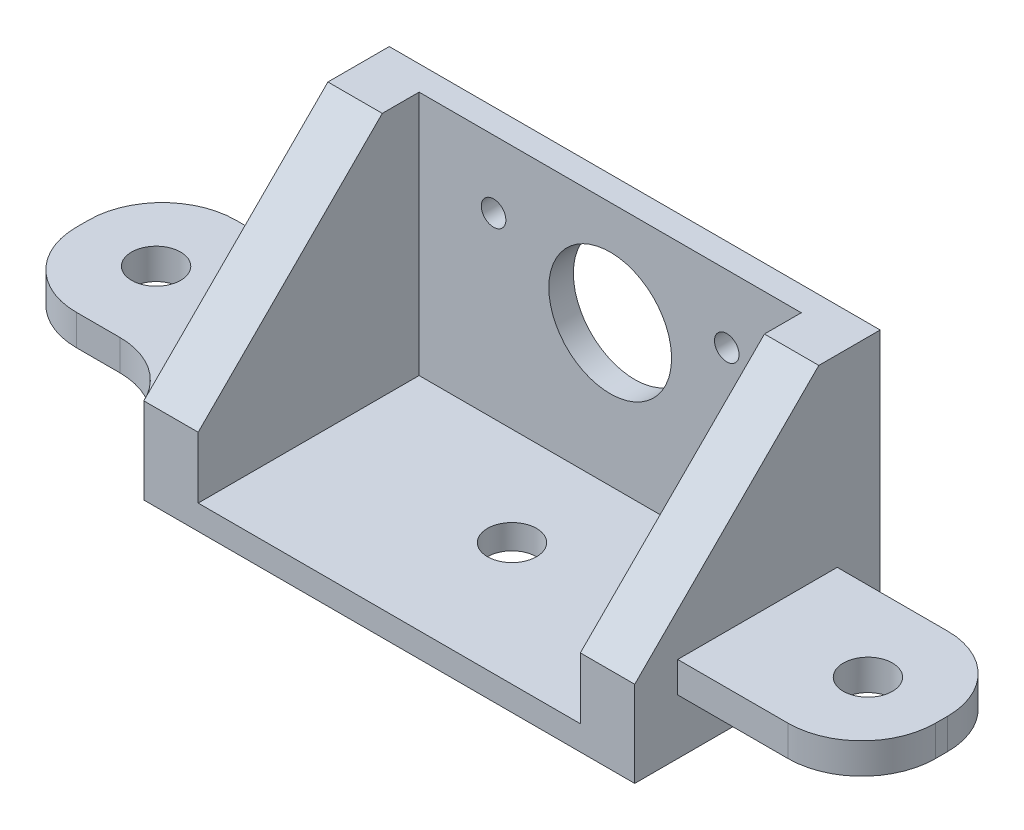
ISO-10303-21;
HEADER;
FILE_DESCRIPTION(('STEP AP214'),'2;1');
FILE_NAME('part.step','',(''),(''),'','','');
FILE_SCHEMA(('AUTOMOTIVE_DESIGN { 1 0 10303 214 1 1 1 1 }'));
ENDSEC;
DATA;
#1=APPLICATION_CONTEXT('core data for automotive mechanical design processes');
#2=APPLICATION_PROTOCOL_DEFINITION('international standard','automotive_design',2000,#1);
#3=PRODUCT_CONTEXT('',#1,'mechanical');
#4=PRODUCT('Part','Part','',(#3));
#5=PRODUCT_RELATED_PRODUCT_CATEGORY('part','',(#4));
#6=PRODUCT_DEFINITION_FORMATION('','',#4);
#7=PRODUCT_DEFINITION_CONTEXT('part definition',#1,'design');
#8=PRODUCT_DEFINITION('design','',#6,#7);
#9=PRODUCT_DEFINITION_SHAPE('','',#8);
#10=(LENGTH_UNIT() NAMED_UNIT(*) SI_UNIT(.MILLI.,.METRE.));
#11=(NAMED_UNIT(*) PLANE_ANGLE_UNIT() SI_UNIT($,.RADIAN.));
#12=(NAMED_UNIT(*) SI_UNIT($,.STERADIAN.) SOLID_ANGLE_UNIT());
#13=UNCERTAINTY_MEASURE_WITH_UNIT(LENGTH_MEASURE(1.E-05),#10,'distance_accuracy_value','');
#14=(GEOMETRIC_REPRESENTATION_CONTEXT(3) GLOBAL_UNCERTAINTY_ASSIGNED_CONTEXT((#13)) GLOBAL_UNIT_ASSIGNED_CONTEXT((#10,
#11,#12)) REPRESENTATION_CONTEXT('',''));
#15=CARTESIAN_POINT('',(0.,0.,0.));
#16=DIRECTION('',(0.,0.,1.));
#17=DIRECTION('',(1.,0.,0.));
#18=AXIS2_PLACEMENT_3D('',#15,#16,#17);
#19=CARTESIAN_POINT('',(-20.,2.,-10.));
#20=DIRECTION('',(1.,0.,0.));
#21=DIRECTION('',(0.,0.,-1.));
#22=AXIS2_PLACEMENT_3D('',#19,#20,#21);
#23=PLANE('',#22);
#24=DIRECTION('',(0.,0.,-1.));
#25=VECTOR('',#24,1.);
#26=CARTESIAN_POINT('',(-20.,6.99999999999995,6.5));
#27=LINE('',#26,#25);
#28=CARTESIAN_POINT('',(-20.,6.99999999999995,10.));
#29=VERTEX_POINT('',#28);
#30=CARTESIAN_POINT('',(-20.,6.99999999999995,-10.));
#31=VERTEX_POINT('',#30);
#32=EDGE_CURVE('E281',#29,#31,#27,.T.);
#33=ORIENTED_EDGE('',*,*,#32,.F.);
#34=DIRECTION('',(0.,0.707106781186549,-0.707106781186546));
#35=VECTOR('',#34,1.);
#36=CARTESIAN_POINT('',(-20.,22.,-4.99999999999999));
#37=LINE('',#36,#35);
#38=CARTESIAN_POINT('',(-20.,22.,-5.));
#39=VERTEX_POINT('',#38);
#40=EDGE_CURVE('E414',#29,#39,#37,.T.);
#41=ORIENTED_EDGE('',*,*,#40,.T.);
#42=DIRECTION('',(0.,0.,1.));
#43=VECTOR('',#42,1.);
#44=CARTESIAN_POINT('',(-20.,22.,-10.));
#45=LINE('',#44,#43);
#46=CARTESIAN_POINT('',(-20.,22.,-10.));
#47=VERTEX_POINT('',#46);
#48=EDGE_CURVE('E335',#47,#39,#45,.T.);
#49=ORIENTED_EDGE('',*,*,#48,.F.);
#50=DIRECTION('',(0.,-1.,0.));
#51=VECTOR('',#50,1.);
#52=CARTESIAN_POINT('',(-20.,2.,-10.));
#53=LINE('',#52,#51);
#54=EDGE_CURVE('E384',#47,#31,#53,.T.);
#55=ORIENTED_EDGE('',*,*,#54,.T.);
#56=EDGE_LOOP('',(#33,#41,#49,#55));
#57=FACE_BOUND('',#56,.T.);
#58=ADVANCED_FACE('F45',(#57),#23,.F.);
#59=DIRECTION('',(0.,-1.,0.));
#60=VECTOR('',#59,1.);
#61=CARTESIAN_POINT('',(-20.,2.,10.));
#62=LINE('',#61,#60);
#63=CARTESIAN_POINT('',(-20.,4.49999999999995,10.));
#64=VERTEX_POINT('',#63);
#65=CARTESIAN_POINT('',(-20.,0.,10.));
#66=VERTEX_POINT('',#65);
#67=EDGE_CURVE('E378',#64,#66,#62,.T.);
#68=ORIENTED_EDGE('',*,*,#67,.F.);
#69=DIRECTION('',(0.,0.,1.));
#70=VECTOR('',#69,1.);
#71=CARTESIAN_POINT('',(-20.,4.49999999999995,6.5));
#72=LINE('',#71,#70);
#73=CARTESIAN_POINT('',(-20.,4.49999999999994,-10.));
#74=VERTEX_POINT('',#73);
#75=EDGE_CURVE('E276',#74,#64,#72,.T.);
#76=ORIENTED_EDGE('',*,*,#75,.F.);
#77=CARTESIAN_POINT('',(-20.,0.,-10.));
#78=VERTEX_POINT('',#77);
#79=EDGE_CURVE('E383',#74,#78,#53,.T.);
#80=ORIENTED_EDGE('',*,*,#79,.T.);
#81=DIRECTION('',(0.,0.,1.));
#82=VECTOR('',#81,1.);
#83=CARTESIAN_POINT('',(-20.,0.,-10.));
#84=LINE('',#83,#82);
#85=EDGE_CURVE('E369',#78,#66,#84,.T.);
#86=ORIENTED_EDGE('',*,*,#85,.T.);
#87=EDGE_LOOP('',(#68,#76,#80,#86));
#88=FACE_BOUND('',#87,.T.);
#89=ADVANCED_FACE('F528',(#88),#23,.F.);
#90=CARTESIAN_POINT('',(0.,2.,0.));
#91=DIRECTION('',(0.,1.,0.));
#92=DIRECTION('',(0.,0.,1.));
#93=AXIS2_PLACEMENT_3D('',#90,#91,#92);
#94=PLANE('',#93);
#95=DIRECTION('',(0.,0.,-1.));
#96=VECTOR('',#95,1.);
#97=CARTESIAN_POINT('',(15.568926153378,2.,-8.));
#98=LINE('',#97,#96);
#99=CARTESIAN_POINT('',(15.568926153378,2.,10.));
#100=VERTEX_POINT('',#99);
#101=CARTESIAN_POINT('',(15.568926153378,2.,-8.));
#102=VERTEX_POINT('',#101);
#103=EDGE_CURVE('E218',#100,#102,#98,.T.);
#104=ORIENTED_EDGE('',*,*,#103,.T.);
#105=DIRECTION('',(1.,0.,0.));
#106=VECTOR('',#105,1.);
#107=CARTESIAN_POINT('',(-20.,2.,-8.));
#108=LINE('',#107,#106);
#109=CARTESIAN_POINT('',(-15.568926153378,2.,-8.));
#110=VERTEX_POINT('',#109);
#111=EDGE_CURVE('E340',#110,#102,#108,.T.);
#112=ORIENTED_EDGE('',*,*,#111,.F.);
#113=DIRECTION('',(0.,0.,-1.));
#114=VECTOR('',#113,1.);
#115=CARTESIAN_POINT('',(-15.568926153378,2.,-8.));
#116=LINE('',#115,#114);
#117=CARTESIAN_POINT('',(-15.568926153378,2.,10.));
#118=VERTEX_POINT('',#117);
#119=EDGE_CURVE('E301',#118,#110,#116,.T.);
#120=ORIENTED_EDGE('',*,*,#119,.F.);
#121=DIRECTION('',(1.,0.,0.));
#122=VECTOR('',#121,1.);
#123=CARTESIAN_POINT('',(-20.,2.,10.));
#124=LINE('',#123,#122);
#125=EDGE_CURVE('E356',#118,#100,#124,.T.);
#126=ORIENTED_EDGE('',*,*,#125,.T.);
#127=EDGE_LOOP('',(#104,#112,#120,#126));
#128=FACE_BOUND('',#127,.T.);
#129=CARTESIAN_POINT('',(0.,2.,0.));
#130=DIRECTION('',(0.,1.,0.));
#131=DIRECTION('',(0.,0.,1.));
#132=AXIS2_PLACEMENT_3D('',#129,#130,#131);
#133=CIRCLE('',#132,2.);
#134=CARTESIAN_POINT('',(0.,2.,2.));
#135=VERTEX_POINT('',#134);
#136=EDGE_CURVE('E318',#135,#135,#133,.T.);
#137=ORIENTED_EDGE('',*,*,#136,.F.);
#138=EDGE_LOOP('',(#137));
#139=FACE_BOUND('',#138,.T.);
#140=ADVANCED_FACE('F534',(#128,#139),#94,.T.);
#141=CARTESIAN_POINT('',(-20.,22.,-8.));
#142=DIRECTION('',(0.,0.,-1.));
#143=DIRECTION('',(-1.,0.,0.));
#144=AXIS2_PLACEMENT_3D('',#141,#142,#143);
#145=PLANE('',#144);
#146=CARTESIAN_POINT('',(0.,13.5,-8.00000000000001));
#147=DIRECTION('',(0.,0.,-1.));
#148=DIRECTION('',(-1.,0.,0.));
#149=AXIS2_PLACEMENT_3D('',#146,#147,#148);
#150=CIRCLE('',#149,5.);
#151=CARTESIAN_POINT('',(-5.,13.5,-8.00000000000001));
#152=VERTEX_POINT('',#151);
#153=EDGE_CURVE('E334',#152,#152,#150,.T.);
#154=ORIENTED_EDGE('',*,*,#153,.T.);
#155=EDGE_LOOP('',(#154));
#156=FACE_BOUND('',#155,.T.);
#157=CARTESIAN_POINT('',(9.5,16.5,-8.00000000000001));
#158=DIRECTION('',(0.,0.,-1.));
#159=DIRECTION('',(-1.,0.,0.));
#160=AXIS2_PLACEMENT_3D('',#157,#158,#159);
#161=CIRCLE('',#160,1.);
#162=CARTESIAN_POINT('',(8.5,16.5,-8.00000000000001));
#163=VERTEX_POINT('',#162);
#164=EDGE_CURVE('E397',#163,#163,#161,.T.);
#165=ORIENTED_EDGE('',*,*,#164,.T.);
#166=EDGE_LOOP('',(#165));
#167=FACE_BOUND('',#166,.T.);
#168=CARTESIAN_POINT('',(-9.5,16.5,-8.00000000000001));
#169=DIRECTION('',(0.,0.,-1.));
#170=DIRECTION('',(-1.,0.,0.));
#171=AXIS2_PLACEMENT_3D('',#168,#169,#170);
#172=CIRCLE('',#171,1.);
#173=CARTESIAN_POINT('',(-10.5,16.5,-8.00000000000001));
#174=VERTEX_POINT('',#173);
#175=EDGE_CURVE('E355',#174,#174,#172,.T.);
#176=ORIENTED_EDGE('',*,*,#175,.T.);
#177=EDGE_LOOP('',(#176));
#178=FACE_BOUND('',#177,.T.);
#179=ORIENTED_EDGE('',*,*,#111,.T.);
#180=DIRECTION('',(0.,-1.,0.));
#181=VECTOR('',#180,1.);
#182=CARTESIAN_POINT('',(15.568926153378,22.,-8.));
#183=LINE('',#182,#181);
#184=CARTESIAN_POINT('',(15.568926153378,22.,-8.));
#185=VERTEX_POINT('',#184);
#186=EDGE_CURVE('E263',#185,#102,#183,.T.);
#187=ORIENTED_EDGE('',*,*,#186,.F.);
#188=DIRECTION('',(1.,0.,0.));
#189=VECTOR('',#188,1.);
#190=CARTESIAN_POINT('',(-20.,22.,-8.));
#191=LINE('',#190,#189);
#192=CARTESIAN_POINT('',(-15.568926153378,22.,-8.));
#193=VERTEX_POINT('',#192);
#194=EDGE_CURVE('E339',#193,#185,#191,.T.);
#195=ORIENTED_EDGE('',*,*,#194,.F.);
#196=DIRECTION('',(0.,-1.,0.));
#197=VECTOR('',#196,1.);
#198=CARTESIAN_POINT('',(-15.568926153378,22.,-8.));
#199=LINE('',#198,#197);
#200=EDGE_CURVE('E305',#193,#110,#199,.T.);
#201=ORIENTED_EDGE('',*,*,#200,.T.);
#202=EDGE_LOOP('',(#179,#187,#195,#201));
#203=FACE_BOUND('',#202,.T.);
#204=ADVANCED_FACE('F546',(#156,#167,#178,#203),#145,.F.);
#205=CARTESIAN_POINT('',(20.,2.,-10.));
#206=DIRECTION('',(-1.,0.,0.));
#207=DIRECTION('',(0.,0.,1.));
#208=AXIS2_PLACEMENT_3D('',#205,#206,#207);
#209=PLANE('',#208);
#210=DIRECTION('',(0.,0.,1.));
#211=VECTOR('',#210,1.);
#212=CARTESIAN_POINT('',(20.,4.49999999999995,6.5));
#213=LINE('',#212,#211);
#214=CARTESIAN_POINT('',(20.,4.49999999999994,-6.5));
#215=VERTEX_POINT('',#214);
#216=CARTESIAN_POINT('',(20.,4.49999999999995,6.5));
#217=VERTEX_POINT('',#216);
#218=EDGE_CURVE('E211',#215,#217,#213,.T.);
#219=ORIENTED_EDGE('',*,*,#218,.T.);
#220=DIRECTION('',(0.,1.,0.));
#221=VECTOR('',#220,1.);
#222=CARTESIAN_POINT('',(20.,6.99999999999995,6.5));
#223=LINE('',#222,#221);
#224=CARTESIAN_POINT('',(20.,6.99999999999995,6.5));
#225=VERTEX_POINT('',#224);
#226=EDGE_CURVE('E222',#217,#225,#223,.T.);
#227=ORIENTED_EDGE('',*,*,#226,.T.);
#228=DIRECTION('',(0.,0.,-1.));
#229=VECTOR('',#228,1.);
#230=CARTESIAN_POINT('',(20.,6.99999999999995,6.5));
#231=LINE('',#230,#229);
#232=CARTESIAN_POINT('',(20.,6.99999999999995,-6.5));
#233=VERTEX_POINT('',#232);
#234=EDGE_CURVE('E239',#225,#233,#231,.T.);
#235=ORIENTED_EDGE('',*,*,#234,.T.);
#236=DIRECTION('',(0.,-1.,0.));
#237=VECTOR('',#236,1.);
#238=CARTESIAN_POINT('',(20.,6.99999999999995,-6.5));
#239=LINE('',#238,#237);
#240=EDGE_CURVE('E235',#233,#215,#239,.T.);
#241=ORIENTED_EDGE('',*,*,#240,.T.);
#242=EDGE_LOOP('',(#219,#227,#235,#241));
#243=FACE_BOUND('',#242,.T.);
#244=DIRECTION('',(0.,0.,-1.));
#245=VECTOR('',#244,1.);
#246=CARTESIAN_POINT('',(20.,22.,-10.));
#247=LINE('',#246,#245);
#248=CARTESIAN_POINT('',(20.,22.,-5.));
#249=VERTEX_POINT('',#248);
#250=CARTESIAN_POINT('',(20.,22.,-10.));
#251=VERTEX_POINT('',#250);
#252=EDGE_CURVE('E344',#249,#251,#247,.T.);
#253=ORIENTED_EDGE('',*,*,#252,.F.);
#254=DIRECTION('',(0.,-0.707106781186549,0.707106781186546));
#255=VECTOR('',#254,1.);
#256=CARTESIAN_POINT('',(20.,6.99999999999995,9.99999999999999));
#257=LINE('',#256,#255);
#258=CARTESIAN_POINT('',(20.,6.99999999999995,10.));
#259=VERTEX_POINT('',#258);
#260=EDGE_CURVE('E478',#249,#259,#257,.T.);
#261=ORIENTED_EDGE('',*,*,#260,.T.);
#262=DIRECTION('',(0.,-1.,0.));
#263=VECTOR('',#262,1.);
#264=CARTESIAN_POINT('',(20.,2.,10.));
#265=LINE('',#264,#263);
#266=CARTESIAN_POINT('',(20.,0.,10.));
#267=VERTEX_POINT('',#266);
#268=EDGE_CURVE('E360',#259,#267,#265,.T.);
#269=ORIENTED_EDGE('',*,*,#268,.T.);
#270=DIRECTION('',(0.,0.,-1.));
#271=VECTOR('',#270,1.);
#272=CARTESIAN_POINT('',(20.,0.,-10.));
#273=LINE('',#272,#271);
#274=CARTESIAN_POINT('',(20.,0.,-10.));
#275=VERTEX_POINT('',#274);
#276=EDGE_CURVE('E351',#267,#275,#273,.T.);
#277=ORIENTED_EDGE('',*,*,#276,.T.);
#278=DIRECTION('',(0.,-1.,0.));
#279=VECTOR('',#278,1.);
#280=CARTESIAN_POINT('',(20.,2.,-10.));
#281=LINE('',#280,#279);
#282=EDGE_CURVE('E388',#251,#275,#281,.T.);
#283=ORIENTED_EDGE('',*,*,#282,.F.);
#284=EDGE_LOOP('',(#253,#261,#269,#277,#283));
#285=FACE_BOUND('',#284,.T.);
#286=ADVANCED_FACE('F232',(#243,#285),#209,.F.);
#287=CARTESIAN_POINT('',(-20.,2.,-10.));
#288=DIRECTION('',(0.,0.,1.));
#289=DIRECTION('',(1.,0.,0.));
#290=AXIS2_PLACEMENT_3D('',#287,#288,#289);
#291=PLANE('',#290);
#292=CARTESIAN_POINT('',(-9.5,16.5,-10.));
#293=DIRECTION('',(0.,0.,-1.));
#294=DIRECTION('',(-1.,0.,0.));
#295=AXIS2_PLACEMENT_3D('',#292,#293,#294);
#296=CIRCLE('',#295,1.);
#297=CARTESIAN_POINT('',(-10.5,16.5,-10.));
#298=VERTEX_POINT('',#297);
#299=EDGE_CURVE('E322',#298,#298,#296,.T.);
#300=ORIENTED_EDGE('',*,*,#299,.F.);
#301=EDGE_LOOP('',(#300));
#302=FACE_BOUND('',#301,.T.);
#303=CARTESIAN_POINT('',(9.5,16.5,-10.));
#304=DIRECTION('',(0.,0.,-1.));
#305=DIRECTION('',(-1.,0.,0.));
#306=AXIS2_PLACEMENT_3D('',#303,#304,#305);
#307=CIRCLE('',#306,1.);
#308=CARTESIAN_POINT('',(8.5,16.5,-10.));
#309=VERTEX_POINT('',#308);
#310=EDGE_CURVE('E323',#309,#309,#307,.T.);
#311=ORIENTED_EDGE('',*,*,#310,.F.);
#312=EDGE_LOOP('',(#311));
#313=FACE_BOUND('',#312,.T.);
#314=CARTESIAN_POINT('',(0.,13.5,-10.));
#315=DIRECTION('',(0.,0.,-1.));
#316=DIRECTION('',(-1.,0.,0.));
#317=AXIS2_PLACEMENT_3D('',#314,#315,#316);
#318=CIRCLE('',#317,5.);
#319=CARTESIAN_POINT('',(-5.,13.5,-10.));
#320=VERTEX_POINT('',#319);
#321=EDGE_CURVE('E327',#320,#320,#318,.T.);
#322=ORIENTED_EDGE('',*,*,#321,.F.);
#323=EDGE_LOOP('',(#322));
#324=FACE_BOUND('',#323,.T.);
#325=DIRECTION('',(-1.,0.,0.));
#326=VECTOR('',#325,1.);
#327=CARTESIAN_POINT('',(-20.,0.,-10.));
#328=LINE('',#327,#326);
#329=EDGE_CURVE('E365',#275,#78,#328,.T.);
#330=ORIENTED_EDGE('',*,*,#329,.T.);
#331=ORIENTED_EDGE('',*,*,#79,.F.);
#332=EDGE_CURVE('E389',#31,#74,#53,.T.);
#333=ORIENTED_EDGE('',*,*,#332,.F.);
#334=ORIENTED_EDGE('',*,*,#54,.F.);
#335=DIRECTION('',(-1.,0.,0.));
#336=VECTOR('',#335,1.);
#337=CARTESIAN_POINT('',(-20.,22.,-10.));
#338=LINE('',#337,#336);
#339=EDGE_CURVE('E347',#251,#47,#338,.T.);
#340=ORIENTED_EDGE('',*,*,#339,.F.);
#341=ORIENTED_EDGE('',*,*,#282,.T.);
#342=EDGE_LOOP('',(#330,#331,#333,#334,#340,#341));
#343=FACE_BOUND('',#342,.T.);
#344=ADVANCED_FACE('F540',(#302,#313,#324,#343),#291,.F.);
#345=CARTESIAN_POINT('',(-20.,2.,10.));
#346=DIRECTION('',(0.,0.,-1.));
#347=DIRECTION('',(-1.,0.,0.));
#348=AXIS2_PLACEMENT_3D('',#345,#346,#347);
#349=PLANE('',#348);
#350=ORIENTED_EDGE('',*,*,#268,.F.);
#351=DIRECTION('',(-1.,0.,0.));
#352=VECTOR('',#351,1.);
#353=CARTESIAN_POINT('',(15.568926153378,6.99999999999995,10.));
#354=LINE('',#353,#352);
#355=CARTESIAN_POINT('',(15.568926153378,6.99999999999995,10.));
#356=VERTEX_POINT('',#355);
#357=EDGE_CURVE('E465',#259,#356,#354,.T.);
#358=ORIENTED_EDGE('',*,*,#357,.T.);
#359=DIRECTION('',(0.,-1.,0.));
#360=VECTOR('',#359,1.);
#361=CARTESIAN_POINT('',(15.568926153378,22.,10.));
#362=LINE('',#361,#360);
#363=EDGE_CURVE('E257',#356,#100,#362,.T.);
#364=ORIENTED_EDGE('',*,*,#363,.T.);
#365=ORIENTED_EDGE('',*,*,#125,.F.);
#366=DIRECTION('',(0.,-1.,0.));
#367=VECTOR('',#366,1.);
#368=CARTESIAN_POINT('',(-15.568926153378,22.,10.));
#369=LINE('',#368,#367);
#370=CARTESIAN_POINT('',(-15.568926153378,6.99999999999995,10.));
#371=VERTEX_POINT('',#370);
#372=EDGE_CURVE('E311',#371,#118,#369,.T.);
#373=ORIENTED_EDGE('',*,*,#372,.F.);
#374=DIRECTION('',(-1.,0.,0.));
#375=VECTOR('',#374,1.);
#376=CARTESIAN_POINT('',(-20.,6.99999999999995,10.));
#377=LINE('',#376,#375);
#378=EDGE_CURVE('E410',#371,#29,#377,.T.);
#379=ORIENTED_EDGE('',*,*,#378,.T.);
#380=EDGE_CURVE('E379',#29,#64,#62,.T.);
#381=ORIENTED_EDGE('',*,*,#380,.T.);
#382=ORIENTED_EDGE('',*,*,#67,.T.);
#383=DIRECTION('',(1.,0.,0.));
#384=VECTOR('',#383,1.);
#385=CARTESIAN_POINT('',(-20.,0.,10.));
#386=LINE('',#385,#384);
#387=EDGE_CURVE('E361',#66,#267,#386,.T.);
#388=ORIENTED_EDGE('',*,*,#387,.T.);
#389=EDGE_LOOP('',(#350,#358,#364,#365,#373,#379,#381,#382,#388));
#390=FACE_BOUND('',#389,.T.);
#391=ADVANCED_FACE('F538',(#390),#349,.F.);
#392=CARTESIAN_POINT('',(0.,0.,0.));
#393=DIRECTION('',(0.,1.,0.));
#394=DIRECTION('',(0.,0.,1.));
#395=AXIS2_PLACEMENT_3D('',#392,#393,#394);
#396=PLANE('',#395);
#397=CARTESIAN_POINT('',(0.,0.,0.));
#398=DIRECTION('',(0.,-1.,0.));
#399=DIRECTION('',(0.,0.,-1.));
#400=AXIS2_PLACEMENT_3D('',#397,#398,#399);
#401=CIRCLE('',#400,2.);
#402=CARTESIAN_POINT('',(0.,0.,-2.));
#403=VERTEX_POINT('',#402);
#404=EDGE_CURVE('E314',#403,#403,#401,.T.);
#405=ORIENTED_EDGE('',*,*,#404,.F.);
#406=EDGE_LOOP('',(#405));
#407=FACE_BOUND('',#406,.T.);
#408=ORIENTED_EDGE('',*,*,#276,.F.);
#409=ORIENTED_EDGE('',*,*,#387,.F.);
#410=ORIENTED_EDGE('',*,*,#85,.F.);
#411=ORIENTED_EDGE('',*,*,#329,.F.);
#412=EDGE_LOOP('',(#408,#409,#410,#411));
#413=FACE_BOUND('',#412,.T.);
#414=ADVANCED_FACE('F649',(#407,#413),#396,.F.);
#415=CARTESIAN_POINT('',(0.,22.,0.));
#416=DIRECTION('',(0.,1.,0.));
#417=DIRECTION('',(0.,0.,1.));
#418=AXIS2_PLACEMENT_3D('',#415,#416,#417);
#419=PLANE('',#418);
#420=DIRECTION('',(0.,0.,-1.));
#421=VECTOR('',#420,1.);
#422=CARTESIAN_POINT('',(15.568926153378,22.,-8.));
#423=LINE('',#422,#421);
#424=CARTESIAN_POINT('',(15.568926153378,22.,-5.));
#425=VERTEX_POINT('',#424);
#426=EDGE_CURVE('E254',#425,#185,#423,.T.);
#427=ORIENTED_EDGE('',*,*,#426,.F.);
#428=DIRECTION('',(1.,0.,0.));
#429=VECTOR('',#428,1.);
#430=CARTESIAN_POINT('',(20.,22.,-5.));
#431=LINE('',#430,#429);
#432=EDGE_CURVE('E475',#425,#249,#431,.T.);
#433=ORIENTED_EDGE('',*,*,#432,.T.);
#434=ORIENTED_EDGE('',*,*,#252,.T.);
#435=ORIENTED_EDGE('',*,*,#339,.T.);
#436=ORIENTED_EDGE('',*,*,#48,.T.);
#437=DIRECTION('',(1.,0.,0.));
#438=VECTOR('',#437,1.);
#439=CARTESIAN_POINT('',(-15.568926153378,22.,-5.));
#440=LINE('',#439,#438);
#441=CARTESIAN_POINT('',(-15.568926153378,22.,-5.));
#442=VERTEX_POINT('',#441);
#443=EDGE_CURVE('E393',#39,#442,#440,.T.);
#444=ORIENTED_EDGE('',*,*,#443,.T.);
#445=DIRECTION('',(0.,0.,-1.));
#446=VECTOR('',#445,1.);
#447=CARTESIAN_POINT('',(-15.568926153378,22.,-8.));
#448=LINE('',#447,#446);
#449=EDGE_CURVE('E302',#442,#193,#448,.T.);
#450=ORIENTED_EDGE('',*,*,#449,.T.);
#451=ORIENTED_EDGE('',*,*,#194,.T.);
#452=EDGE_LOOP('',(#427,#433,#434,#435,#436,#444,#450,#451));
#453=FACE_BOUND('',#452,.T.);
#454=ADVANCED_FACE('F645',(#453),#419,.T.);
#455=CARTESIAN_POINT('',(0.,13.5,10.));
#456=DIRECTION('',(0.,0.,-1.));
#457=DIRECTION('',(-1.,0.,0.));
#458=AXIS2_PLACEMENT_3D('',#455,#456,#457);
#459=CYLINDRICAL_SURFACE('',#458,5.);
#460=ORIENTED_EDGE('',*,*,#321,.T.);
#461=EDGE_LOOP('',(#460));
#462=FACE_BOUND('',#461,.T.);
#463=ORIENTED_EDGE('',*,*,#153,.F.);
#464=EDGE_LOOP('',(#463));
#465=FACE_BOUND('',#464,.T.);
#466=ADVANCED_FACE('F638',(#462,#465),#459,.F.);
#467=CARTESIAN_POINT('',(9.5,16.5,10.));
#468=DIRECTION('',(0.,0.,-1.));
#469=DIRECTION('',(-1.,0.,0.));
#470=AXIS2_PLACEMENT_3D('',#467,#468,#469);
#471=CYLINDRICAL_SURFACE('',#470,1.);
#472=ORIENTED_EDGE('',*,*,#310,.T.);
#473=EDGE_LOOP('',(#472));
#474=FACE_BOUND('',#473,.T.);
#475=ORIENTED_EDGE('',*,*,#164,.F.);
#476=EDGE_LOOP('',(#475));
#477=FACE_BOUND('',#476,.T.);
#478=ADVANCED_FACE('F635',(#474,#477),#471,.F.);
#479=CARTESIAN_POINT('',(-9.5,16.5,10.));
#480=DIRECTION('',(0.,0.,-1.));
#481=DIRECTION('',(-1.,0.,0.));
#482=AXIS2_PLACEMENT_3D('',#479,#480,#481);
#483=CYLINDRICAL_SURFACE('',#482,1.);
#484=ORIENTED_EDGE('',*,*,#299,.T.);
#485=EDGE_LOOP('',(#484));
#486=FACE_BOUND('',#485,.T.);
#487=ORIENTED_EDGE('',*,*,#175,.F.);
#488=EDGE_LOOP('',(#487));
#489=FACE_BOUND('',#488,.T.);
#490=ADVANCED_FACE('F633',(#486,#489),#483,.F.);
#491=CARTESIAN_POINT('',(0.,22.,0.));
#492=DIRECTION('',(0.,-1.,0.));
#493=DIRECTION('',(0.,0.,-1.));
#494=AXIS2_PLACEMENT_3D('',#491,#492,#493);
#495=CYLINDRICAL_SURFACE('',#494,2.);
#496=ORIENTED_EDGE('',*,*,#136,.T.);
#497=EDGE_LOOP('',(#496));
#498=FACE_BOUND('',#497,.T.);
#499=ORIENTED_EDGE('',*,*,#404,.T.);
#500=EDGE_LOOP('',(#499));
#501=FACE_BOUND('',#500,.T.);
#502=ADVANCED_FACE('F629',(#498,#501),#495,.F.);
#503=CARTESIAN_POINT('',(-15.568926153378,22.,-8.));
#504=DIRECTION('',(-1.,0.,0.));
#505=DIRECTION('',(0.,0.,1.));
#506=AXIS2_PLACEMENT_3D('',#503,#504,#505);
#507=PLANE('',#506);
#508=ORIENTED_EDGE('',*,*,#449,.F.);
#509=DIRECTION('',(0.,-0.707106781186549,0.707106781186546));
#510=VECTOR('',#509,1.);
#511=CARTESIAN_POINT('',(-15.568926153378,22.,-5.));
#512=LINE('',#511,#510);
#513=EDGE_CURVE('E407',#442,#371,#512,.T.);
#514=ORIENTED_EDGE('',*,*,#513,.T.);
#515=ORIENTED_EDGE('',*,*,#372,.T.);
#516=ORIENTED_EDGE('',*,*,#119,.T.);
#517=ORIENTED_EDGE('',*,*,#200,.F.);
#518=EDGE_LOOP('',(#508,#514,#515,#516,#517));
#519=FACE_BOUND('',#518,.T.);
#520=ADVANCED_FACE('F555',(#519),#507,.F.);
#521=CARTESIAN_POINT('',(0.,22.,-5.));
#522=DIRECTION('',(0.,0.707106781186546,0.707106781186549));
#523=DIRECTION('',(-1.,0.,0.));
#524=AXIS2_PLACEMENT_3D('',#521,#522,#523);
#525=PLANE('',#524);
#526=ORIENTED_EDGE('',*,*,#40,.F.);
#527=ORIENTED_EDGE('',*,*,#378,.F.);
#528=ORIENTED_EDGE('',*,*,#513,.F.);
#529=ORIENTED_EDGE('',*,*,#443,.F.);
#530=EDGE_LOOP('',(#526,#527,#528,#529));
#531=FACE_BOUND('',#530,.T.);
#532=ADVANCED_FACE('F548',(#531),#525,.T.);
#533=CARTESIAN_POINT('',(-35.,6.99999999999995,6.5));
#534=DIRECTION('',(0.,0.,-1.));
#535=DIRECTION('',(-1.,0.,0.));
#536=AXIS2_PLACEMENT_3D('',#533,#534,#535);
#537=PLANE('',#536);
#538=DIRECTION('',(1.,0.,0.));
#539=VECTOR('',#538,1.);
#540=CARTESIAN_POINT('',(-35.,4.49999999999995,6.5));
#541=LINE('',#540,#539);
#542=CARTESIAN_POINT('',(-29.,4.49999999999995,6.5));
#543=VERTEX_POINT('',#542);
#544=CARTESIAN_POINT('',(-25.4543560573179,4.49999999999995,6.5));
#545=VERTEX_POINT('',#544);
#546=EDGE_CURVE('E280',#543,#545,#541,.T.);
#547=ORIENTED_EDGE('',*,*,#546,.T.);
#548=DIRECTION('',(0.,1.,0.));
#549=VECTOR('',#548,1.);
#550=CARTESIAN_POINT('',(-25.4543560573179,6.99999999999995,6.5));
#551=LINE('',#550,#549);
#552=CARTESIAN_POINT('',(-25.4543560573179,6.99999999999995,6.5));
#553=VERTEX_POINT('',#552);
#554=EDGE_CURVE('E420',#545,#553,#551,.T.);
#555=ORIENTED_EDGE('',*,*,#554,.T.);
#556=DIRECTION('',(1.,0.,0.));
#557=VECTOR('',#556,1.);
#558=CARTESIAN_POINT('',(-35.,6.99999999999995,6.5));
#559=LINE('',#558,#557);
#560=CARTESIAN_POINT('',(-29.,6.99999999999995,6.5));
#561=VERTEX_POINT('',#560);
#562=EDGE_CURVE('E297',#561,#553,#559,.T.);
#563=ORIENTED_EDGE('',*,*,#562,.F.);
#564=DIRECTION('',(0.,1.,0.));
#565=VECTOR('',#564,1.);
#566=CARTESIAN_POINT('',(-29.,6.99999999999995,6.5));
#567=LINE('',#566,#565);
#568=EDGE_CURVE('E417',#561,#543,#567,.F.);
#569=ORIENTED_EDGE('',*,*,#568,.T.);
#570=EDGE_LOOP('',(#547,#555,#563,#569));
#571=FACE_BOUND('',#570,.T.);
#572=ADVANCED_FACE('F554',(#571),#537,.F.);
#573=CARTESIAN_POINT('',(-35.,6.99999999999995,6.5));
#574=DIRECTION('',(0.,-1.,0.));
#575=DIRECTION('',(0.,0.,-1.));
#576=AXIS2_PLACEMENT_3D('',#573,#574,#575);
#577=PLANE('',#576);
#578=CARTESIAN_POINT('',(-29.,6.99999999999995,0.));
#579=DIRECTION('',(0.,1.,0.));
#580=DIRECTION('',(0.,0.,1.));
#581=AXIS2_PLACEMENT_3D('',#578,#579,#580);
#582=CIRCLE('',#581,2.);
#583=CARTESIAN_POINT('',(-29.,6.99999999999995,2.00000000000001));
#584=VERTEX_POINT('',#583);
#585=EDGE_CURVE('E266',#584,#584,#582,.T.);
#586=ORIENTED_EDGE('',*,*,#585,.F.);
#587=EDGE_LOOP('',(#586));
#588=FACE_BOUND('',#587,.T.);
#589=DIRECTION('',(0.,0.,-1.));
#590=VECTOR('',#589,1.);
#591=CARTESIAN_POINT('',(-35.,6.99999999999995,6.5));
#592=LINE('',#591,#590);
#593=CARTESIAN_POINT('',(-35.,6.99999999999995,0.500000000000004));
#594=VERTEX_POINT('',#593);
#595=CARTESIAN_POINT('',(-35.,6.99999999999995,-0.499999999999997));
#596=VERTEX_POINT('',#595);
#597=EDGE_CURVE('E271',#594,#596,#592,.T.);
#598=ORIENTED_EDGE('',*,*,#597,.F.);
#599=CARTESIAN_POINT('',(-29.,6.99999999999995,0.500000000000001));
#600=DIRECTION('',(0.,-1.,0.));
#601=DIRECTION('',(0.,0.,-1.));
#602=AXIS2_PLACEMENT_3D('',#599,#600,#601);
#603=CIRCLE('',#602,6.);
#604=EDGE_CURVE('E442',#594,#561,#603,.F.);
#605=ORIENTED_EDGE('',*,*,#604,.T.);
#606=ORIENTED_EDGE('',*,*,#562,.T.);
#607=CARTESIAN_POINT('',(-25.4543560573179,6.99999999999995,12.5));
#608=DIRECTION('',(0.,-1.,0.));
#609=DIRECTION('',(0.,0.,-1.));
#610=AXIS2_PLACEMENT_3D('',#607,#608,#609);
#611=CIRCLE('',#610,6.);
#612=EDGE_CURVE('E451',#553,#29,#611,.T.);
#613=ORIENTED_EDGE('',*,*,#612,.T.);
#614=ORIENTED_EDGE('',*,*,#32,.T.);
#615=CARTESIAN_POINT('',(-25.4543560573179,6.99999999999994,-12.5));
#616=DIRECTION('',(0.,-1.,0.));
#617=DIRECTION('',(0.,0.,-1.));
#618=AXIS2_PLACEMENT_3D('',#615,#616,#617);
#619=CIRCLE('',#618,6.);
#620=CARTESIAN_POINT('',(-25.4543560573179,6.99999999999995,-6.5));
#621=VERTEX_POINT('',#620);
#622=EDGE_CURVE('E462',#31,#621,#619,.T.);
#623=ORIENTED_EDGE('',*,*,#622,.T.);
#624=DIRECTION('',(1.,0.,0.));
#625=VECTOR('',#624,1.);
#626=CARTESIAN_POINT('',(-35.,6.99999999999995,-6.5));
#627=LINE('',#626,#625);
#628=CARTESIAN_POINT('',(-29.,6.99999999999995,-6.5));
#629=VERTEX_POINT('',#628);
#630=EDGE_CURVE('E293',#629,#621,#627,.T.);
#631=ORIENTED_EDGE('',*,*,#630,.F.);
#632=CARTESIAN_POINT('',(-29.,6.99999999999995,-0.5));
#633=DIRECTION('',(0.,-1.,0.));
#634=DIRECTION('',(0.,0.,-1.));
#635=AXIS2_PLACEMENT_3D('',#632,#633,#634);
#636=CIRCLE('',#635,6.);
#637=EDGE_CURVE('E439',#629,#596,#636,.F.);
#638=ORIENTED_EDGE('',*,*,#637,.T.);
#639=EDGE_LOOP('',(#598,#605,#606,#613,#614,#623,#631,#638));
#640=FACE_BOUND('',#639,.T.);
#641=ADVANCED_FACE('F619',(#588,#640),#577,.F.);
#642=CARTESIAN_POINT('',(-35.,6.99999999999995,-6.5));
#643=DIRECTION('',(0.,0.,1.));
#644=DIRECTION('',(1.,0.,0.));
#645=AXIS2_PLACEMENT_3D('',#642,#643,#644);
#646=PLANE('',#645);
#647=ORIENTED_EDGE('',*,*,#630,.T.);
#648=DIRECTION('',(0.,-1.,0.));
#649=VECTOR('',#648,1.);
#650=CARTESIAN_POINT('',(-25.4543560573179,6.99999999999995,-6.5));
#651=LINE('',#650,#649);
#652=CARTESIAN_POINT('',(-25.4543560573179,4.49999999999994,-6.5));
#653=VERTEX_POINT('',#652);
#654=EDGE_CURVE('E427',#621,#653,#651,.T.);
#655=ORIENTED_EDGE('',*,*,#654,.T.);
#656=DIRECTION('',(1.,0.,0.));
#657=VECTOR('',#656,1.);
#658=CARTESIAN_POINT('',(-35.,4.49999999999994,-6.5));
#659=LINE('',#658,#657);
#660=CARTESIAN_POINT('',(-29.,4.49999999999994,-6.5));
#661=VERTEX_POINT('',#660);
#662=EDGE_CURVE('E289',#661,#653,#659,.T.);
#663=ORIENTED_EDGE('',*,*,#662,.F.);
#664=DIRECTION('',(0.,-1.,0.));
#665=VECTOR('',#664,1.);
#666=CARTESIAN_POINT('',(-29.,6.99999999999995,-6.5));
#667=LINE('',#666,#665);
#668=EDGE_CURVE('E424',#661,#629,#667,.F.);
#669=ORIENTED_EDGE('',*,*,#668,.T.);
#670=EDGE_LOOP('',(#647,#655,#663,#669));
#671=FACE_BOUND('',#670,.T.);
#672=ADVANCED_FACE('F615',(#671),#646,.F.);
#673=CARTESIAN_POINT('',(-35.,4.49999999999995,6.5));
#674=DIRECTION('',(0.,1.,0.));
#675=DIRECTION('',(0.,0.,1.));
#676=AXIS2_PLACEMENT_3D('',#673,#674,#675);
#677=PLANE('',#676);
#678=CARTESIAN_POINT('',(-29.,4.49999999999995,0.));
#679=DIRECTION('',(0.,1.,0.));
#680=DIRECTION('',(0.,0.,1.));
#681=AXIS2_PLACEMENT_3D('',#678,#679,#680);
#682=CIRCLE('',#681,2.);
#683=CARTESIAN_POINT('',(-29.,4.49999999999995,2.00000000000001));
#684=VERTEX_POINT('',#683);
#685=EDGE_CURVE('E270',#684,#684,#682,.T.);
#686=ORIENTED_EDGE('',*,*,#685,.T.);
#687=EDGE_LOOP('',(#686));
#688=FACE_BOUND('',#687,.T.);
#689=ORIENTED_EDGE('',*,*,#546,.F.);
#690=CARTESIAN_POINT('',(-29.,4.49999999999995,0.5));
#691=DIRECTION('',(0.,1.,0.));
#692=DIRECTION('',(0.,0.,1.));
#693=AXIS2_PLACEMENT_3D('',#690,#691,#692);
#694=CIRCLE('',#693,6.);
#695=CARTESIAN_POINT('',(-35.,4.49999999999995,0.500000000000005));
#696=VERTEX_POINT('',#695);
#697=EDGE_CURVE('E448',#543,#696,#694,.F.);
#698=ORIENTED_EDGE('',*,*,#697,.T.);
#699=DIRECTION('',(0.,0.,1.));
#700=VECTOR('',#699,1.);
#701=CARTESIAN_POINT('',(-35.,4.49999999999995,6.5));
#702=LINE('',#701,#700);
#703=CARTESIAN_POINT('',(-35.,4.49999999999995,-0.499999999999994));
#704=VERTEX_POINT('',#703);
#705=EDGE_CURVE('E275',#704,#696,#702,.T.);
#706=ORIENTED_EDGE('',*,*,#705,.F.);
#707=CARTESIAN_POINT('',(-29.,4.49999999999995,-0.499999999999999));
#708=DIRECTION('',(0.,1.,0.));
#709=DIRECTION('',(0.,0.,1.));
#710=AXIS2_PLACEMENT_3D('',#707,#708,#709);
#711=CIRCLE('',#710,6.);
#712=EDGE_CURVE('E445',#704,#661,#711,.F.);
#713=ORIENTED_EDGE('',*,*,#712,.T.);
#714=ORIENTED_EDGE('',*,*,#662,.T.);
#715=CARTESIAN_POINT('',(-25.4543560573179,4.49999999999994,-12.5));
#716=DIRECTION('',(0.,1.,0.));
#717=DIRECTION('',(0.,0.,1.));
#718=AXIS2_PLACEMENT_3D('',#715,#716,#717);
#719=CIRCLE('',#718,6.);
#720=EDGE_CURVE('E458',#653,#74,#719,.T.);
#721=ORIENTED_EDGE('',*,*,#720,.T.);
#722=ORIENTED_EDGE('',*,*,#75,.T.);
#723=CARTESIAN_POINT('',(-25.4543560573179,4.49999999999995,12.5));
#724=DIRECTION('',(0.,1.,0.));
#725=DIRECTION('',(0.,0.,1.));
#726=AXIS2_PLACEMENT_3D('',#723,#724,#725);
#727=CIRCLE('',#726,6.);
#728=EDGE_CURVE('E455',#64,#545,#727,.T.);
#729=ORIENTED_EDGE('',*,*,#728,.T.);
#730=EDGE_LOOP('',(#689,#698,#706,#713,#714,#721,#722,#729));
#731=FACE_BOUND('',#730,.T.);
#732=ADVANCED_FACE('F611',(#688,#731),#677,.F.);
#733=CARTESIAN_POINT('',(-35.,0.,0.));
#734=DIRECTION('',(1.,0.,0.));
#735=DIRECTION('',(0.,0.,-1.));
#736=AXIS2_PLACEMENT_3D('',#733,#734,#735);
#737=PLANE('',#736);
#738=ORIENTED_EDGE('',*,*,#705,.T.);
#739=DIRECTION('',(0.,1.,0.));
#740=VECTOR('',#739,1.);
#741=CARTESIAN_POINT('',(-35.,0.,0.500000000000002));
#742=LINE('',#741,#740);
#743=EDGE_CURVE('E435',#696,#594,#742,.T.);
#744=ORIENTED_EDGE('',*,*,#743,.T.);
#745=ORIENTED_EDGE('',*,*,#597,.T.);
#746=DIRECTION('',(0.,-1.,0.));
#747=VECTOR('',#746,1.);
#748=CARTESIAN_POINT('',(-35.,0.,-0.499999999999994));
#749=LINE('',#748,#747);
#750=EDGE_CURVE('E431',#596,#704,#749,.T.);
#751=ORIENTED_EDGE('',*,*,#750,.T.);
#752=EDGE_LOOP('',(#738,#744,#745,#751));
#753=FACE_BOUND('',#752,.T.);
#754=ADVANCED_FACE('F561',(#753),#737,.F.);
#755=CARTESIAN_POINT('',(-25.4543560573179,2.,12.5));
#756=DIRECTION('',(0.,1.,0.));
#757=DIRECTION('',(0.,0.,1.));
#758=AXIS2_PLACEMENT_3D('',#755,#756,#757);
#759=CYLINDRICAL_SURFACE('',#758,6.);
#760=ORIENTED_EDGE('',*,*,#728,.F.);
#761=ORIENTED_EDGE('',*,*,#380,.F.);
#762=ORIENTED_EDGE('',*,*,#612,.F.);
#763=ORIENTED_EDGE('',*,*,#554,.F.);
#764=EDGE_LOOP('',(#760,#761,#762,#763));
#765=FACE_BOUND('',#764,.T.);
#766=ADVANCED_FACE('F557',(#765),#759,.F.);
#767=CARTESIAN_POINT('',(-25.4543560573179,2.,-12.5));
#768=DIRECTION('',(0.,-1.,0.));
#769=DIRECTION('',(0.,0.,-1.));
#770=AXIS2_PLACEMENT_3D('',#767,#768,#769);
#771=CYLINDRICAL_SURFACE('',#770,6.);
#772=ORIENTED_EDGE('',*,*,#622,.F.);
#773=ORIENTED_EDGE('',*,*,#332,.T.);
#774=ORIENTED_EDGE('',*,*,#720,.F.);
#775=ORIENTED_EDGE('',*,*,#654,.F.);
#776=EDGE_LOOP('',(#772,#773,#774,#775));
#777=FACE_BOUND('',#776,.T.);
#778=ADVANCED_FACE('F560',(#777),#771,.F.);
#779=CARTESIAN_POINT('',(-29.,0.,0.499999999999999));
#780=DIRECTION('',(0.,1.,0.));
#781=DIRECTION('',(0.,0.,1.));
#782=AXIS2_PLACEMENT_3D('',#779,#780,#781);
#783=CYLINDRICAL_SURFACE('',#782,6.);
#784=ORIENTED_EDGE('',*,*,#697,.F.);
#785=ORIENTED_EDGE('',*,*,#568,.F.);
#786=ORIENTED_EDGE('',*,*,#604,.F.);
#787=ORIENTED_EDGE('',*,*,#743,.F.);
#788=EDGE_LOOP('',(#784,#785,#786,#787));
#789=FACE_BOUND('',#788,.T.);
#790=ADVANCED_FACE('F565',(#789),#783,.T.);
#791=CARTESIAN_POINT('',(-29.,0.,-0.499999999999998));
#792=DIRECTION('',(0.,-1.,0.));
#793=DIRECTION('',(0.,0.,-1.));
#794=AXIS2_PLACEMENT_3D('',#791,#792,#793);
#795=CYLINDRICAL_SURFACE('',#794,6.);
#796=ORIENTED_EDGE('',*,*,#637,.F.);
#797=ORIENTED_EDGE('',*,*,#668,.F.);
#798=ORIENTED_EDGE('',*,*,#712,.F.);
#799=ORIENTED_EDGE('',*,*,#750,.F.);
#800=EDGE_LOOP('',(#796,#797,#798,#799));
#801=FACE_BOUND('',#800,.T.);
#802=ADVANCED_FACE('F569',(#801),#795,.T.);
#803=CARTESIAN_POINT('',(-29.,0.,0.));
#804=DIRECTION('',(0.,1.,0.));
#805=DIRECTION('',(0.,0.,1.));
#806=AXIS2_PLACEMENT_3D('',#803,#804,#805);
#807=CYLINDRICAL_SURFACE('',#806,2.);
#808=ORIENTED_EDGE('',*,*,#585,.T.);
#809=EDGE_LOOP('',(#808));
#810=FACE_BOUND('',#809,.T.);
#811=ORIENTED_EDGE('',*,*,#685,.F.);
#812=EDGE_LOOP('',(#811));
#813=FACE_BOUND('',#812,.T.);
#814=ADVANCED_FACE('F573',(#810,#813),#807,.F.);
#815=CARTESIAN_POINT('',(15.568926153378,22.,-8.));
#816=DIRECTION('',(-1.,0.,0.));
#817=DIRECTION('',(0.,0.,1.));
#818=AXIS2_PLACEMENT_3D('',#815,#816,#817);
#819=PLANE('',#818);
#820=ORIENTED_EDGE('',*,*,#363,.F.);
#821=DIRECTION('',(0.,0.707106781186549,-0.707106781186546));
#822=VECTOR('',#821,1.);
#823=CARTESIAN_POINT('',(15.568926153378,23.5,-6.5));
#824=LINE('',#823,#822);
#825=EDGE_CURVE('E472',#356,#425,#824,.T.);
#826=ORIENTED_EDGE('',*,*,#825,.T.);
#827=ORIENTED_EDGE('',*,*,#426,.T.);
#828=ORIENTED_EDGE('',*,*,#186,.T.);
#829=ORIENTED_EDGE('',*,*,#103,.F.);
#830=EDGE_LOOP('',(#820,#826,#827,#828,#829));
#831=FACE_BOUND('',#830,.T.);
#832=ADVANCED_FACE('F579',(#831),#819,.T.);
#833=CARTESIAN_POINT('',(-20.,6.99999999999995,10.));
#834=DIRECTION('',(0.,0.707106781186546,0.707106781186549));
#835=DIRECTION('',(1.,0.,0.));
#836=AXIS2_PLACEMENT_3D('',#833,#834,#835);
#837=PLANE('',#836);
#838=ORIENTED_EDGE('',*,*,#260,.F.);
#839=ORIENTED_EDGE('',*,*,#432,.F.);
#840=ORIENTED_EDGE('',*,*,#825,.F.);
#841=ORIENTED_EDGE('',*,*,#357,.F.);
#842=EDGE_LOOP('',(#838,#839,#840,#841));
#843=FACE_BOUND('',#842,.T.);
#844=ADVANCED_FACE('F575',(#843),#837,.T.);
#845=CARTESIAN_POINT('',(35.,6.99999999999995,6.5));
#846=DIRECTION('',(0.,0.,1.));
#847=DIRECTION('',(1.,0.,0.));
#848=AXIS2_PLACEMENT_3D('',#845,#846,#847);
#849=PLANE('',#848);
#850=DIRECTION('',(-1.,0.,0.));
#851=VECTOR('',#850,1.);
#852=CARTESIAN_POINT('',(35.,4.49999999999995,6.5));
#853=LINE('',#852,#851);
#854=CARTESIAN_POINT('',(29.,4.49999999999995,6.5));
#855=VERTEX_POINT('',#854);
#856=EDGE_CURVE('E206',#855,#217,#853,.T.);
#857=ORIENTED_EDGE('',*,*,#856,.F.);
#858=DIRECTION('',(0.,1.,0.));
#859=VECTOR('',#858,1.);
#860=CARTESIAN_POINT('',(29.,6.99999999999995,6.5));
#861=LINE('',#860,#859);
#862=CARTESIAN_POINT('',(29.,6.99999999999995,6.5));
#863=VERTEX_POINT('',#862);
#864=EDGE_CURVE('E481',#855,#863,#861,.T.);
#865=ORIENTED_EDGE('',*,*,#864,.T.);
#866=DIRECTION('',(-1.,0.,0.));
#867=VECTOR('',#866,1.);
#868=CARTESIAN_POINT('',(35.,6.99999999999995,6.5));
#869=LINE('',#868,#867);
#870=EDGE_CURVE('E225',#863,#225,#869,.T.);
#871=ORIENTED_EDGE('',*,*,#870,.T.);
#872=ORIENTED_EDGE('',*,*,#226,.F.);
#873=EDGE_LOOP('',(#857,#865,#871,#872));
#874=FACE_BOUND('',#873,.T.);
#875=ADVANCED_FACE('F223',(#874),#849,.T.);
#876=CARTESIAN_POINT('',(35.,4.49999999999995,6.5));
#877=DIRECTION('',(0.,-1.,0.));
#878=DIRECTION('',(0.,0.,-1.));
#879=AXIS2_PLACEMENT_3D('',#876,#877,#878);
#880=PLANE('',#879);
#881=CARTESIAN_POINT('',(29.,4.49999999999995,0.));
#882=DIRECTION('',(0.,-1.,0.));
#883=DIRECTION('',(0.,0.,-1.));
#884=AXIS2_PLACEMENT_3D('',#881,#882,#883);
#885=CIRCLE('',#884,2.);
#886=CARTESIAN_POINT('',(29.,4.49999999999995,-2.));
#887=VERTEX_POINT('',#886);
#888=EDGE_CURVE('E230',#887,#887,#885,.F.);
#889=ORIENTED_EDGE('',*,*,#888,.T.);
#890=EDGE_LOOP('',(#889));
#891=FACE_BOUND('',#890,.T.);
#892=DIRECTION('',(0.,0.,1.));
#893=VECTOR('',#892,1.);
#894=CARTESIAN_POINT('',(35.,4.49999999999995,6.5));
#895=LINE('',#894,#893);
#896=CARTESIAN_POINT('',(35.,4.49999999999995,-0.499999999999994));
#897=VERTEX_POINT('',#896);
#898=CARTESIAN_POINT('',(35.,4.49999999999995,0.500000000000005));
#899=VERTEX_POINT('',#898);
#900=EDGE_CURVE('E245',#897,#899,#895,.T.);
#901=ORIENTED_EDGE('',*,*,#900,.T.);
#902=CARTESIAN_POINT('',(29.,4.49999999999995,0.5));
#903=DIRECTION('',(0.,-1.,0.));
#904=DIRECTION('',(0.,0.,-1.));
#905=AXIS2_PLACEMENT_3D('',#902,#903,#904);
#906=CIRCLE('',#905,6.);
#907=EDGE_CURVE('E54',#899,#855,#906,.T.);
#908=ORIENTED_EDGE('',*,*,#907,.T.);
#909=ORIENTED_EDGE('',*,*,#856,.T.);
#910=ORIENTED_EDGE('',*,*,#218,.F.);
#911=DIRECTION('',(-1.,0.,0.));
#912=VECTOR('',#911,1.);
#913=CARTESIAN_POINT('',(35.,4.49999999999994,-6.5));
#914=LINE('',#913,#912);
#915=CARTESIAN_POINT('',(29.,4.49999999999994,-6.5));
#916=VERTEX_POINT('',#915);
#917=EDGE_CURVE('E219',#916,#215,#914,.T.);
#918=ORIENTED_EDGE('',*,*,#917,.F.);
#919=CARTESIAN_POINT('',(29.,4.49999999999995,-0.499999999999999));
#920=DIRECTION('',(0.,-1.,0.));
#921=DIRECTION('',(0.,0.,-1.));
#922=AXIS2_PLACEMENT_3D('',#919,#920,#921);
#923=CIRCLE('',#922,6.);
#924=EDGE_CURVE('E61',#916,#897,#923,.T.);
#925=ORIENTED_EDGE('',*,*,#924,.T.);
#926=EDGE_LOOP('',(#901,#908,#909,#910,#918,#925));
#927=FACE_BOUND('',#926,.T.);
#928=ADVANCED_FACE('F208',(#891,#927),#880,.T.);
#929=CARTESIAN_POINT('',(35.,6.99999999999995,-6.5));
#930=DIRECTION('',(0.,0.,-1.));
#931=DIRECTION('',(-1.,0.,0.));
#932=AXIS2_PLACEMENT_3D('',#929,#930,#931);
#933=PLANE('',#932);
#934=DIRECTION('',(-1.,0.,0.));
#935=VECTOR('',#934,1.);
#936=CARTESIAN_POINT('',(35.,6.99999999999995,-6.5));
#937=LINE('',#936,#935);
#938=CARTESIAN_POINT('',(29.,6.99999999999995,-6.5));
#939=VERTEX_POINT('',#938);
#940=EDGE_CURVE('E248',#939,#233,#937,.T.);
#941=ORIENTED_EDGE('',*,*,#940,.F.);
#942=DIRECTION('',(0.,-1.,0.));
#943=VECTOR('',#942,1.);
#944=CARTESIAN_POINT('',(29.,4.49999999999994,-6.5));
#945=LINE('',#944,#943);
#946=EDGE_CURVE('E11',#939,#916,#945,.T.);
#947=ORIENTED_EDGE('',*,*,#946,.T.);
#948=ORIENTED_EDGE('',*,*,#917,.T.);
#949=ORIENTED_EDGE('',*,*,#240,.F.);
#950=EDGE_LOOP('',(#941,#947,#948,#949));
#951=FACE_BOUND('',#950,.T.);
#952=ADVANCED_FACE('F590',(#951),#933,.T.);
#953=CARTESIAN_POINT('',(35.,6.99999999999995,6.5));
#954=DIRECTION('',(0.,1.,0.));
#955=DIRECTION('',(0.,0.,1.));
#956=AXIS2_PLACEMENT_3D('',#953,#954,#955);
#957=PLANE('',#956);
#958=CARTESIAN_POINT('',(29.,6.99999999999995,0.));
#959=DIRECTION('',(0.,-1.,0.));
#960=DIRECTION('',(0.,0.,1.));
#961=AXIS2_PLACEMENT_3D('',#958,#959,#960);
#962=CIRCLE('',#961,2.);
#963=CARTESIAN_POINT('',(29.,6.99999999999995,2.00000000000001));
#964=VERTEX_POINT('',#963);
#965=EDGE_CURVE('E509',#964,#964,#962,.T.);
#966=ORIENTED_EDGE('',*,*,#965,.T.);
#967=EDGE_LOOP('',(#966));
#968=FACE_BOUND('',#967,.T.);
#969=ORIENTED_EDGE('',*,*,#870,.F.);
#970=CARTESIAN_POINT('',(29.,6.99999999999995,0.500000000000001));
#971=DIRECTION('',(0.,1.,0.));
#972=DIRECTION('',(0.,0.,1.));
#973=AXIS2_PLACEMENT_3D('',#970,#971,#972);
#974=CIRCLE('',#973,6.);
#975=CARTESIAN_POINT('',(35.,6.99999999999995,0.500000000000004));
#976=VERTEX_POINT('',#975);
#977=EDGE_CURVE('E487',#863,#976,#974,.T.);
#978=ORIENTED_EDGE('',*,*,#977,.T.);
#979=DIRECTION('',(0.,0.,-1.));
#980=VECTOR('',#979,1.);
#981=CARTESIAN_POINT('',(35.,6.99999999999995,6.5));
#982=LINE('',#981,#980);
#983=CARTESIAN_POINT('',(35.,6.99999999999995,-0.499999999999997));
#984=VERTEX_POINT('',#983);
#985=EDGE_CURVE('E249',#976,#984,#982,.T.);
#986=ORIENTED_EDGE('',*,*,#985,.T.);
#987=CARTESIAN_POINT('',(29.,6.99999999999995,-0.5));
#988=DIRECTION('',(0.,1.,0.));
#989=DIRECTION('',(0.,0.,1.));
#990=AXIS2_PLACEMENT_3D('',#987,#988,#989);
#991=CIRCLE('',#990,6.);
#992=EDGE_CURVE('E484',#984,#939,#991,.T.);
#993=ORIENTED_EDGE('',*,*,#992,.T.);
#994=ORIENTED_EDGE('',*,*,#940,.T.);
#995=ORIENTED_EDGE('',*,*,#234,.F.);
#996=EDGE_LOOP('',(#969,#978,#986,#993,#994,#995));
#997=FACE_BOUND('',#996,.T.);
#998=ADVANCED_FACE('F514',(#968,#997),#957,.T.);
#999=CARTESIAN_POINT('',(35.,0.,0.));
#1000=DIRECTION('',(-1.,0.,0.));
#1001=DIRECTION('',(0.,0.,-1.));
#1002=AXIS2_PLACEMENT_3D('',#999,#1000,#1001);
#1003=PLANE('',#1002);
#1004=ORIENTED_EDGE('',*,*,#985,.F.);
#1005=DIRECTION('',(0.,1.,0.));
#1006=VECTOR('',#1005,1.);
#1007=CARTESIAN_POINT('',(35.,4.49999999999995,0.500000000000003));
#1008=LINE('',#1007,#1006);
#1009=EDGE_CURVE('E68',#976,#899,#1008,.F.);
#1010=ORIENTED_EDGE('',*,*,#1009,.T.);
#1011=ORIENTED_EDGE('',*,*,#900,.F.);
#1012=DIRECTION('',(0.,-1.,0.));
#1013=VECTOR('',#1012,1.);
#1014=CARTESIAN_POINT('',(35.,6.99999999999995,-0.499999999999997));
#1015=LINE('',#1014,#1013);
#1016=EDGE_CURVE('E490',#897,#984,#1015,.F.);
#1017=ORIENTED_EDGE('',*,*,#1016,.T.);
#1018=EDGE_LOOP('',(#1004,#1010,#1011,#1017));
#1019=FACE_BOUND('',#1018,.T.);
#1020=ADVANCED_FACE('F582',(#1019),#1003,.F.);
#1021=CARTESIAN_POINT('',(29.,6.99999999999995,0.500000000000001));
#1022=DIRECTION('',(0.,-1.,0.));
#1023=DIRECTION('',(0.,0.,-1.));
#1024=AXIS2_PLACEMENT_3D('',#1021,#1022,#1023);
#1025=CYLINDRICAL_SURFACE('',#1024,6.);
#1026=ORIENTED_EDGE('',*,*,#907,.F.);
#1027=ORIENTED_EDGE('',*,*,#1009,.F.);
#1028=ORIENTED_EDGE('',*,*,#977,.F.);
#1029=ORIENTED_EDGE('',*,*,#864,.F.);
#1030=EDGE_LOOP('',(#1026,#1027,#1028,#1029));
#1031=FACE_BOUND('',#1030,.T.);
#1032=ADVANCED_FACE('F524',(#1031),#1025,.T.);
#1033=CARTESIAN_POINT('',(29.,6.99999999999995,-0.5));
#1034=DIRECTION('',(0.,1.,0.));
#1035=DIRECTION('',(0.,0.,1.));
#1036=AXIS2_PLACEMENT_3D('',#1033,#1034,#1035);
#1037=CYLINDRICAL_SURFACE('',#1036,6.);
#1038=ORIENTED_EDGE('',*,*,#992,.F.);
#1039=ORIENTED_EDGE('',*,*,#1016,.F.);
#1040=ORIENTED_EDGE('',*,*,#924,.F.);
#1041=ORIENTED_EDGE('',*,*,#946,.F.);
#1042=EDGE_LOOP('',(#1038,#1039,#1040,#1041));
#1043=FACE_BOUND('',#1042,.T.);
#1044=ADVANCED_FACE('F47',(#1043),#1037,.T.);
#1045=CARTESIAN_POINT('',(29.,0.,0.));
#1046=DIRECTION('',(0.,1.,0.));
#1047=DIRECTION('',(0.,0.,1.));
#1048=AXIS2_PLACEMENT_3D('',#1045,#1046,#1047);
#1049=CYLINDRICAL_SURFACE('',#1048,2.);
#1050=ORIENTED_EDGE('',*,*,#888,.F.);
#1051=EDGE_LOOP('',(#1050));
#1052=FACE_BOUND('',#1051,.T.);
#1053=ORIENTED_EDGE('',*,*,#965,.F.);
#1054=EDGE_LOOP('',(#1053));
#1055=FACE_BOUND('',#1054,.T.);
#1056=ADVANCED_FACE('F517',(#1052,#1055),#1049,.F.);
#1057=CLOSED_SHELL('',(#58,#89,#140,#204,#286,#344,#391,#414,#454,#466,#478,#490,#502,#520,#532,
#572,#641,#672,#732,#754,#766,#778,#790,#802,#814,#832,#844,#875,#928,#952,#998,#1020,#1032,
#1044,#1056));
#1058=MANIFOLD_SOLID_BREP('B2',#1057);
#1059=ADVANCED_BREP_SHAPE_REPRESENTATION('',(#18,#1058),#14);
#1060=SHAPE_DEFINITION_REPRESENTATION(#9,#1059);
ENDSEC;
END-ISO-10303-21;
